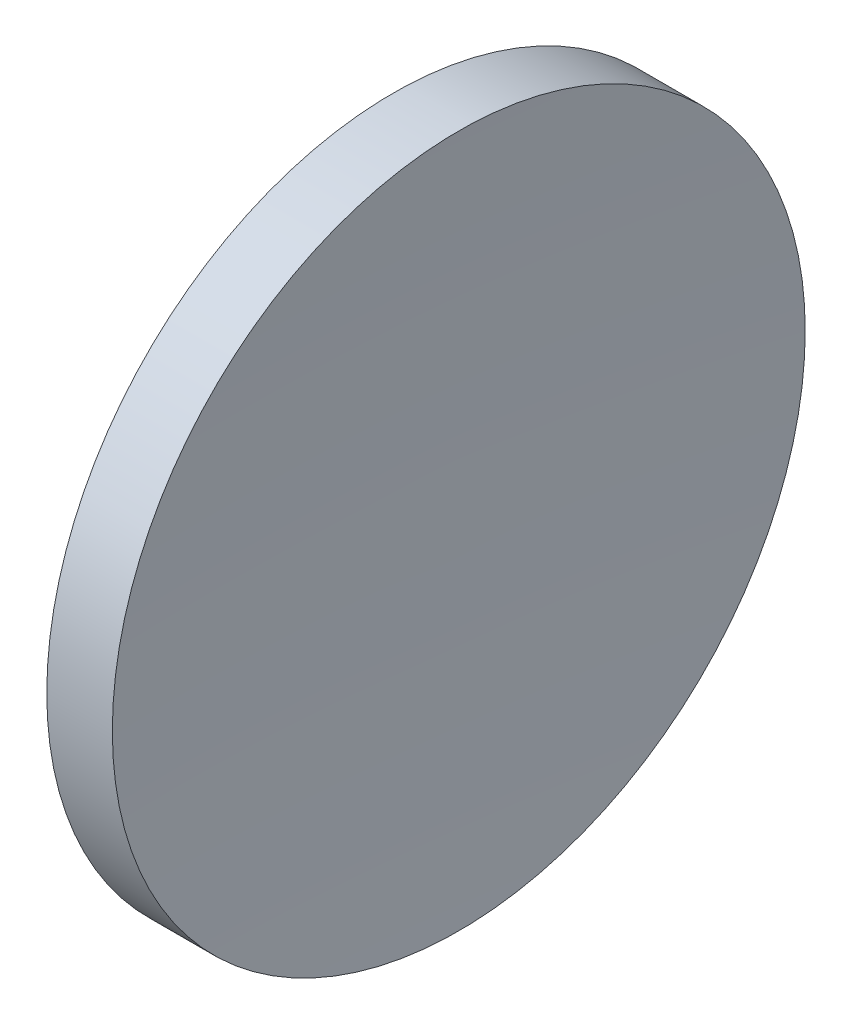
ISO-10303-21;
HEADER;
FILE_DESCRIPTION(('STEP AP214'),'2;1');
FILE_NAME('part.step','',(''),(''),'','','');
FILE_SCHEMA(('AUTOMOTIVE_DESIGN { 1 0 10303 214 1 1 1 1 }'));
ENDSEC;
DATA;
#1=APPLICATION_CONTEXT('core data for automotive mechanical design processes');
#2=APPLICATION_PROTOCOL_DEFINITION('international standard','automotive_design',2000,#1);
#3=PRODUCT_CONTEXT('',#1,'mechanical');
#4=PRODUCT('Part','Part','',(#3));
#5=PRODUCT_RELATED_PRODUCT_CATEGORY('part','',(#4));
#6=PRODUCT_DEFINITION_FORMATION('','',#4);
#7=PRODUCT_DEFINITION_CONTEXT('part definition',#1,'design');
#8=PRODUCT_DEFINITION('design','',#6,#7);
#9=PRODUCT_DEFINITION_SHAPE('','',#8);
#10=(LENGTH_UNIT() NAMED_UNIT(*) SI_UNIT(.MILLI.,.METRE.));
#11=(NAMED_UNIT(*) PLANE_ANGLE_UNIT() SI_UNIT($,.RADIAN.));
#12=(NAMED_UNIT(*) SI_UNIT($,.STERADIAN.) SOLID_ANGLE_UNIT());
#13=UNCERTAINTY_MEASURE_WITH_UNIT(LENGTH_MEASURE(1.E-05),#10,'distance_accuracy_value','');
#14=(GEOMETRIC_REPRESENTATION_CONTEXT(3) GLOBAL_UNCERTAINTY_ASSIGNED_CONTEXT((#13)) GLOBAL_UNIT_ASSIGNED_CONTEXT((#10,
#11,#12)) REPRESENTATION_CONTEXT('',''));
#15=CARTESIAN_POINT('',(0.,0.,0.));
#16=DIRECTION('',(0.,0.,1.));
#17=DIRECTION('',(1.,0.,0.));
#18=AXIS2_PLACEMENT_3D('',#15,#16,#17);
#19=CARTESIAN_POINT('',(265.632204248433,32.6107681292268,0.233969719376961));
#20=DIRECTION('',(0.,-1.,0.));
#21=DIRECTION('',(0.,0.,1.));
#22=AXIS2_PLACEMENT_3D('',#19,#20,#21);
#23=CIRCLE('',#22,206.1);
#24=TRIMMED_CURVE('',#23,(PARAMETER_VALUE(-1.57193155129578)),
(PARAMETER_VALUE(1.57193155129578)),.T.,.PARAMETER.);
#25=CARTESIAN_POINT('',(265.632204248433,32.6107681292268,0.));
#26=DIRECTION('',(-1.,0.,0.));
#27=AXIS1_PLACEMENT('',#25,#26);
#28=SURFACE_OF_REVOLUTION('',#24,#27);
#29=CARTESIAN_POINT('',(59.897534099829,32.6107681292268,0.));
#30=DIRECTION('',(-1.,0.,0.));
#31=DIRECTION('',(0.,0.,1.));
#32=AXIS2_PLACEMENT_3D('',#29,#30,#31);
#33=CIRCLE('',#32,12.5);
#34=CARTESIAN_POINT('',(59.897534099829,32.6107681292268,12.5));
#35=VERTEX_POINT('',#34);
#36=EDGE_CURVE('E11',#35,#35,#33,.T.);
#37=ORIENTED_EDGE('',*,*,#36,.F.);
#38=EDGE_LOOP('',(#37));
#39=FACE_BOUND('',#38,.T.);
#40=CARTESIAN_POINT('',(59.5323370525261,32.6107681292268,0.));
#41=VERTEX_POINT('',#40);
#42=VERTEX_LOOP('',#41);
#43=FACE_BOUND('',#42,.T.);
#44=ADVANCED_FACE('F37',(#39,#43),#28,.F.);
#45=CARTESIAN_POINT('',(56.1009150799972,32.6107681292268,0.));
#46=DIRECTION('',(-1.,0.,0.));
#47=DIRECTION('',(0.,0.,1.));
#48=AXIS2_PLACEMENT_3D('',#45,#46,#47);
#49=CYLINDRICAL_SURFACE('',#48,12.5);
#50=CARTESIAN_POINT('',(57.5323370525261,32.6107681292268,0.));
#51=DIRECTION('',(-1.,0.,0.));
#52=DIRECTION('',(0.,0.,1.));
#53=AXIS2_PLACEMENT_3D('',#50,#51,#52);
#54=CIRCLE('',#53,12.5);
#55=CARTESIAN_POINT('',(57.5323370525261,32.6107681292268,12.5));
#56=VERTEX_POINT('',#55);
#57=EDGE_CURVE('E43',#56,#56,#54,.T.);
#58=ORIENTED_EDGE('',*,*,#57,.F.);
#59=EDGE_LOOP('',(#58));
#60=FACE_BOUND('',#59,.T.);
#61=ORIENTED_EDGE('',*,*,#36,.T.);
#62=EDGE_LOOP('',(#61));
#63=FACE_BOUND('',#62,.T.);
#64=ADVANCED_FACE('F47',(#60,#63),#49,.T.);
#65=CARTESIAN_POINT('',(57.5323370525261,32.6107681292268,0.));
#66=DIRECTION('',(1.,0.,0.));
#67=DIRECTION('',(0.,0.,-1.));
#68=AXIS2_PLACEMENT_3D('',#65,#66,#67);
#69=PLANE('',#68);
#70=ORIENTED_EDGE('',*,*,#57,.T.);
#71=EDGE_LOOP('',(#70));
#72=FACE_BOUND('',#71,.T.);
#73=ADVANCED_FACE('F52',(#72),#69,.F.);
#74=CLOSED_SHELL('',(#44,#64,#73));
#75=MANIFOLD_SOLID_BREP('B2',#74);
#76=ADVANCED_BREP_SHAPE_REPRESENTATION('',(#18,#75),#14);
#77=SHAPE_DEFINITION_REPRESENTATION(#9,#76);
ENDSEC;
END-ISO-10303-21;
